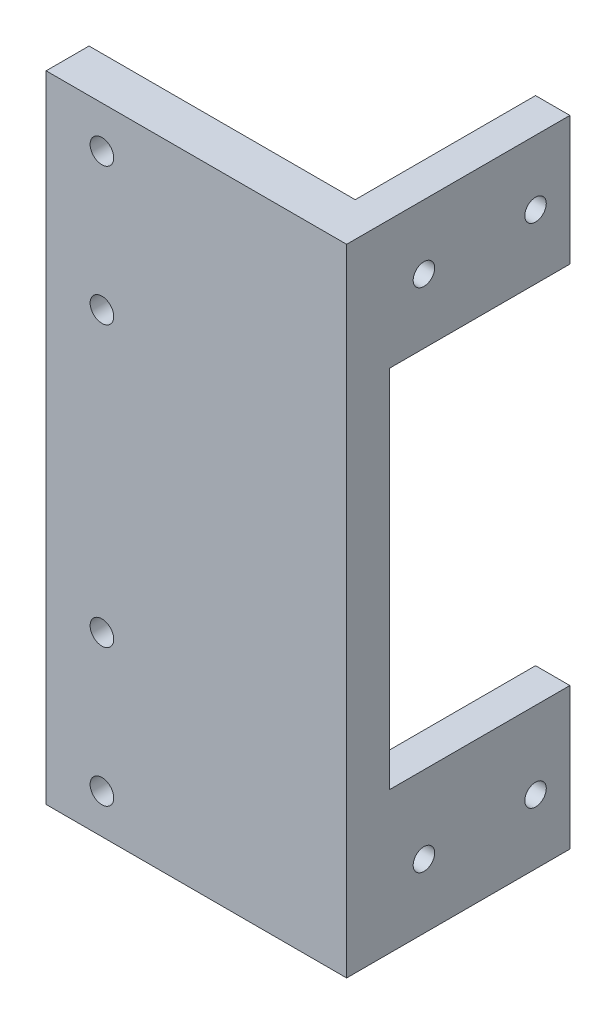
ISO-10303-21;
HEADER;
FILE_DESCRIPTION(('STEP AP214'),'2;1');
FILE_NAME('part.step','',(''),(''),'','','');
FILE_SCHEMA(('AUTOMOTIVE_DESIGN { 1 0 10303 214 1 1 1 1 }'));
ENDSEC;
DATA;
#1=APPLICATION_CONTEXT('core data for automotive mechanical design processes');
#2=APPLICATION_PROTOCOL_DEFINITION('international standard','automotive_design',2000,#1);
#3=PRODUCT_CONTEXT('',#1,'mechanical');
#4=PRODUCT('Part','Part','',(#3));
#5=PRODUCT_RELATED_PRODUCT_CATEGORY('part','',(#4));
#6=PRODUCT_DEFINITION_FORMATION('','',#4);
#7=PRODUCT_DEFINITION_CONTEXT('part definition',#1,'design');
#8=PRODUCT_DEFINITION('design','',#6,#7);
#9=PRODUCT_DEFINITION_SHAPE('','',#8);
#10=(LENGTH_UNIT() NAMED_UNIT(*) SI_UNIT(.MILLI.,.METRE.));
#11=(NAMED_UNIT(*) PLANE_ANGLE_UNIT() SI_UNIT($,.RADIAN.));
#12=(NAMED_UNIT(*) SI_UNIT($,.STERADIAN.) SOLID_ANGLE_UNIT());
#13=UNCERTAINTY_MEASURE_WITH_UNIT(LENGTH_MEASURE(1.E-05),#10,'distance_accuracy_value','');
#14=(GEOMETRIC_REPRESENTATION_CONTEXT(3) GLOBAL_UNCERTAINTY_ASSIGNED_CONTEXT((#13)) GLOBAL_UNIT_ASSIGNED_CONTEXT((#10,
#11,#12)) REPRESENTATION_CONTEXT('',''));
#15=CARTESIAN_POINT('',(0.,0.,0.));
#16=DIRECTION('',(0.,0.,1.));
#17=DIRECTION('',(1.,0.,0.));
#18=AXIS2_PLACEMENT_3D('',#15,#16,#17);
#19=CARTESIAN_POINT('',(0.,0.,-10.));
#20=DIRECTION('',(0.,0.,1.));
#21=DIRECTION('',(-1.,0.,0.));
#22=AXIS2_PLACEMENT_3D('',#19,#20,#21);
#23=PLANE('',#22);
#24=DIRECTION('',(0.,-1.,0.));
#25=VECTOR('',#24,1.);
#26=CARTESIAN_POINT('',(57.,-144.,-10.));
#27=LINE('',#26,#25);
#28=CARTESIAN_POINT('',(57.,-111.,-10.));
#29=VERTEX_POINT('',#28);
#30=CARTESIAN_POINT('',(57.,-144.,-10.));
#31=VERTEX_POINT('',#30);
#32=EDGE_CURVE('E113',#29,#31,#27,.T.);
#33=ORIENTED_EDGE('',*,*,#32,.T.);
#34=DIRECTION('',(1.,0.,0.));
#35=VECTOR('',#34,1.);
#36=CARTESIAN_POINT('',(-5.00000000000002,-144.,-10.));
#37=LINE('',#36,#35);
#38=CARTESIAN_POINT('',(-5.00000000000002,-144.,-10.));
#39=VERTEX_POINT('',#38);
#40=EDGE_CURVE('E160',#39,#31,#37,.T.);
#41=ORIENTED_EDGE('',*,*,#40,.F.);
#42=DIRECTION('',(0.,-1.,0.));
#43=VECTOR('',#42,1.);
#44=CARTESIAN_POINT('',(-5.00000000000002,-144.,-10.));
#45=LINE('',#44,#43);
#46=CARTESIAN_POINT('',(-5.00000000000002,4.,-10.));
#47=VERTEX_POINT('',#46);
#48=EDGE_CURVE('E157',#47,#39,#45,.T.);
#49=ORIENTED_EDGE('',*,*,#48,.F.);
#50=DIRECTION('',(-1.,0.,0.));
#51=VECTOR('',#50,1.);
#52=CARTESIAN_POINT('',(-5.00000000000002,4.,-10.));
#53=LINE('',#52,#51);
#54=CARTESIAN_POINT('',(57.,4.,-10.));
#55=VERTEX_POINT('',#54);
#56=EDGE_CURVE('E164',#55,#47,#53,.T.);
#57=ORIENTED_EDGE('',*,*,#56,.F.);
#58=DIRECTION('',(0.,-1.,0.));
#59=VECTOR('',#58,1.);
#60=CARTESIAN_POINT('',(57.,4.,-10.));
#61=LINE('',#60,#59);
#62=CARTESIAN_POINT('',(57.,-26.,-10.));
#63=VERTEX_POINT('',#62);
#64=EDGE_CURVE('E192',#55,#63,#61,.T.);
#65=ORIENTED_EDGE('',*,*,#64,.T.);
#66=DIRECTION('',(1.,0.,0.));
#67=VECTOR('',#66,1.);
#68=CARTESIAN_POINT('',(65.,-26.,-10.));
#69=LINE('',#68,#67);
#70=CARTESIAN_POINT('',(65.,-26.,-10.));
#71=VERTEX_POINT('',#70);
#72=EDGE_CURVE('E200',#63,#71,#69,.T.);
#73=ORIENTED_EDGE('',*,*,#72,.T.);
#74=DIRECTION('',(0.,1.,0.));
#75=VECTOR('',#74,1.);
#76=CARTESIAN_POINT('',(65.,-144.,-10.));
#77=LINE('',#76,#75);
#78=CARTESIAN_POINT('',(65.,-111.,-10.));
#79=VERTEX_POINT('',#78);
#80=EDGE_CURVE('E138',#79,#71,#77,.T.);
#81=ORIENTED_EDGE('',*,*,#80,.F.);
#82=DIRECTION('',(-1.,0.,0.));
#83=VECTOR('',#82,1.);
#84=CARTESIAN_POINT('',(15.,-111.,-10.));
#85=LINE('',#84,#83);
#86=EDGE_CURVE('E130',#79,#29,#85,.T.);
#87=ORIENTED_EDGE('',*,*,#86,.T.);
#88=EDGE_LOOP('',(#33,#41,#49,#57,#65,#73,#81,#87));
#89=FACE_BOUND('',#88,.T.);
#90=CARTESIAN_POINT('',(7.99999999999998,-5.70000000000219,-10.));
#91=DIRECTION('',(0.,0.,-1.));
#92=DIRECTION('',(-1.,0.,0.));
#93=AXIS2_PLACEMENT_3D('',#90,#91,#92);
#94=CIRCLE('',#93,2.75);
#95=CARTESIAN_POINT('',(5.24999999999998,-5.70000000000219,-10.));
#96=VERTEX_POINT('',#95);
#97=EDGE_CURVE('E262',#96,#96,#94,.F.);
#98=ORIENTED_EDGE('',*,*,#97,.T.);
#99=EDGE_LOOP('',(#98));
#100=FACE_BOUND('',#99,.T.);
#101=CARTESIAN_POINT('',(7.99999999999999,-37.7000000000022,-10.));
#102=DIRECTION('',(0.,0.,-1.));
#103=DIRECTION('',(-1.,0.,0.));
#104=AXIS2_PLACEMENT_3D('',#101,#102,#103);
#105=CIRCLE('',#104,2.75);
#106=CARTESIAN_POINT('',(5.24999999999999,-37.7000000000022,-10.));
#107=VERTEX_POINT('',#106);
#108=EDGE_CURVE('E256',#107,#107,#105,.F.);
#109=ORIENTED_EDGE('',*,*,#108,.T.);
#110=EDGE_LOOP('',(#109));
#111=FACE_BOUND('',#110,.T.);
#112=CARTESIAN_POINT('',(8.00000000000002,-134.80000000001,-10.));
#113=DIRECTION('',(0.,0.,-1.));
#114=DIRECTION('',(-1.,0.,0.));
#115=AXIS2_PLACEMENT_3D('',#112,#113,#114);
#116=CIRCLE('',#115,2.75);
#117=CARTESIAN_POINT('',(5.25000000000002,-134.80000000001,-10.));
#118=VERTEX_POINT('',#117);
#119=EDGE_CURVE('E250',#118,#118,#116,.F.);
#120=ORIENTED_EDGE('',*,*,#119,.T.);
#121=EDGE_LOOP('',(#120));
#122=FACE_BOUND('',#121,.T.);
#123=CARTESIAN_POINT('',(8.00000000000001,-102.800000000009,-10.));
#124=DIRECTION('',(0.,0.,-1.));
#125=DIRECTION('',(-1.,0.,0.));
#126=AXIS2_PLACEMENT_3D('',#123,#124,#125);
#127=CIRCLE('',#126,2.75);
#128=CARTESIAN_POINT('',(5.25000000000001,-102.800000000009,-10.));
#129=VERTEX_POINT('',#128);
#130=EDGE_CURVE('E244',#129,#129,#127,.F.);
#131=ORIENTED_EDGE('',*,*,#130,.T.);
#132=EDGE_LOOP('',(#131));
#133=FACE_BOUND('',#132,.T.);
#134=ADVANCED_FACE('F33',(#89,#100,#111,#122,#133),#23,.F.);
#135=CARTESIAN_POINT('',(-5.00000000000002,-144.,-10.));
#136=DIRECTION('',(1.,0.,0.));
#137=DIRECTION('',(0.,0.,1.));
#138=AXIS2_PLACEMENT_3D('',#135,#136,#137);
#139=PLANE('',#138);
#140=DIRECTION('',(0.,-1.,0.));
#141=VECTOR('',#140,1.);
#142=CARTESIAN_POINT('',(-5.00000000000002,-144.,0.));
#143=LINE('',#142,#141);
#144=CARTESIAN_POINT('',(-5.00000000000002,4.,0.));
#145=VERTEX_POINT('',#144);
#146=CARTESIAN_POINT('',(-5.00000000000002,-144.,0.));
#147=VERTEX_POINT('',#146);
#148=EDGE_CURVE('E150',#145,#147,#143,.T.);
#149=ORIENTED_EDGE('',*,*,#148,.F.);
#150=DIRECTION('',(0.,0.,1.));
#151=VECTOR('',#150,1.);
#152=CARTESIAN_POINT('',(-5.00000000000002,4.,-10.));
#153=LINE('',#152,#151);
#154=EDGE_CURVE('E166',#47,#145,#153,.T.);
#155=ORIENTED_EDGE('',*,*,#154,.F.);
#156=ORIENTED_EDGE('',*,*,#48,.T.);
#157=DIRECTION('',(0.,0.,1.));
#158=VECTOR('',#157,1.);
#159=CARTESIAN_POINT('',(-5.00000000000002,-144.,-10.));
#160=LINE('',#159,#158);
#161=EDGE_CURVE('E11',#39,#147,#160,.T.);
#162=ORIENTED_EDGE('',*,*,#161,.T.);
#163=EDGE_LOOP('',(#149,#155,#156,#162));
#164=FACE_BOUND('',#163,.T.);
#165=ADVANCED_FACE('F35',(#164),#139,.F.);
#166=CARTESIAN_POINT('',(-5.00000000000002,-144.,-10.));
#167=DIRECTION('',(0.,1.,0.));
#168=DIRECTION('',(0.,0.,-1.));
#169=AXIS2_PLACEMENT_3D('',#166,#167,#168);
#170=PLANE('',#169);
#171=DIRECTION('',(1.,0.,0.));
#172=VECTOR('',#171,1.);
#173=CARTESIAN_POINT('',(-5.00000000000002,-144.,0.));
#174=LINE('',#173,#172);
#175=CARTESIAN_POINT('',(65.,-144.,0.));
#176=VERTEX_POINT('',#175);
#177=EDGE_CURVE('E153',#147,#176,#174,.T.);
#178=ORIENTED_EDGE('',*,*,#177,.F.);
#179=ORIENTED_EDGE('',*,*,#161,.F.);
#180=ORIENTED_EDGE('',*,*,#40,.T.);
#181=DIRECTION('',(0.,0.,1.));
#182=VECTOR('',#181,1.);
#183=CARTESIAN_POINT('',(57.,-144.,-52.));
#184=LINE('',#183,#182);
#185=CARTESIAN_POINT('',(57.,-144.,-52.));
#186=VERTEX_POINT('',#185);
#187=EDGE_CURVE('E119',#186,#31,#184,.T.);
#188=ORIENTED_EDGE('',*,*,#187,.F.);
#189=DIRECTION('',(1.,0.,0.));
#190=VECTOR('',#189,1.);
#191=CARTESIAN_POINT('',(65.,-144.,-52.));
#192=LINE('',#191,#190);
#193=CARTESIAN_POINT('',(65.,-144.,-52.));
#194=VERTEX_POINT('',#193);
#195=EDGE_CURVE('E184',#186,#194,#192,.T.);
#196=ORIENTED_EDGE('',*,*,#195,.T.);
#197=DIRECTION('',(0.,0.,1.));
#198=VECTOR('',#197,1.);
#199=CARTESIAN_POINT('',(65.,-144.,-10.));
#200=LINE('',#199,#198);
#201=EDGE_CURVE('E42',#194,#176,#200,.T.);
#202=ORIENTED_EDGE('',*,*,#201,.T.);
#203=EDGE_LOOP('',(#178,#179,#180,#188,#196,#202));
#204=FACE_BOUND('',#203,.T.);
#205=ADVANCED_FACE('F183',(#204),#170,.F.);
#206=CARTESIAN_POINT('',(65.,-144.,-10.));
#207=DIRECTION('',(-1.,0.,0.));
#208=DIRECTION('',(0.,-1.,0.));
#209=AXIS2_PLACEMENT_3D('',#206,#207,#208);
#210=PLANE('',#209);
#211=CARTESIAN_POINT('',(65.,-129.,-18.));
#212=DIRECTION('',(1.,0.,0.));
#213=DIRECTION('',(0.,-1.,0.));
#214=AXIS2_PLACEMENT_3D('',#211,#212,#213);
#215=CIRCLE('',#214,2.5);
#216=CARTESIAN_POINT('',(65.,-131.5,-18.));
#217=VERTEX_POINT('',#216);
#218=EDGE_CURVE('E238',#217,#217,#215,.F.);
#219=ORIENTED_EDGE('',*,*,#218,.T.);
#220=EDGE_LOOP('',(#219));
#221=FACE_BOUND('',#220,.T.);
#222=CARTESIAN_POINT('',(65.,-129.,-44.));
#223=DIRECTION('',(1.,0.,0.));
#224=DIRECTION('',(0.,-1.,0.));
#225=AXIS2_PLACEMENT_3D('',#222,#223,#224);
#226=CIRCLE('',#225,2.5);
#227=CARTESIAN_POINT('',(65.,-131.5,-44.));
#228=VERTEX_POINT('',#227);
#229=EDGE_CURVE('E232',#228,#228,#226,.F.);
#230=ORIENTED_EDGE('',*,*,#229,.T.);
#231=EDGE_LOOP('',(#230));
#232=FACE_BOUND('',#231,.T.);
#233=CARTESIAN_POINT('',(65.,-11.,-44.));
#234=DIRECTION('',(1.,0.,0.));
#235=DIRECTION('',(0.,-1.,0.));
#236=AXIS2_PLACEMENT_3D('',#233,#234,#235);
#237=CIRCLE('',#236,2.5);
#238=CARTESIAN_POINT('',(65.,-13.5,-44.));
#239=VERTEX_POINT('',#238);
#240=EDGE_CURVE('E226',#239,#239,#237,.F.);
#241=ORIENTED_EDGE('',*,*,#240,.T.);
#242=EDGE_LOOP('',(#241));
#243=FACE_BOUND('',#242,.T.);
#244=CARTESIAN_POINT('',(65.,-11.,-18.));
#245=DIRECTION('',(1.,0.,0.));
#246=DIRECTION('',(0.,-1.,0.));
#247=AXIS2_PLACEMENT_3D('',#244,#245,#246);
#248=CIRCLE('',#247,2.5);
#249=CARTESIAN_POINT('',(65.,-13.5,-18.));
#250=VERTEX_POINT('',#249);
#251=EDGE_CURVE('E124',#250,#250,#248,.F.);
#252=ORIENTED_EDGE('',*,*,#251,.T.);
#253=EDGE_LOOP('',(#252));
#254=FACE_BOUND('',#253,.T.);
#255=DIRECTION('',(0.,1.,0.));
#256=VECTOR('',#255,1.);
#257=CARTESIAN_POINT('',(65.,-144.,0.));
#258=LINE('',#257,#256);
#259=CARTESIAN_POINT('',(65.,4.,0.));
#260=VERTEX_POINT('',#259);
#261=EDGE_CURVE('E170',#176,#260,#258,.T.);
#262=ORIENTED_EDGE('',*,*,#261,.F.);
#263=ORIENTED_EDGE('',*,*,#201,.F.);
#264=DIRECTION('',(0.,1.,0.));
#265=VECTOR('',#264,1.);
#266=CARTESIAN_POINT('',(65.,-111.,-52.));
#267=LINE('',#266,#265);
#268=CARTESIAN_POINT('',(65.,-111.,-52.));
#269=VERTEX_POINT('',#268);
#270=EDGE_CURVE('E139',#194,#269,#267,.T.);
#271=ORIENTED_EDGE('',*,*,#270,.T.);
#272=DIRECTION('',(0.,0.,1.));
#273=VECTOR('',#272,1.);
#274=CARTESIAN_POINT('',(65.,-111.,-52.));
#275=LINE('',#274,#273);
#276=EDGE_CURVE('E149',#269,#79,#275,.T.);
#277=ORIENTED_EDGE('',*,*,#276,.T.);
#278=ORIENTED_EDGE('',*,*,#80,.T.);
#279=DIRECTION('',(0.,0.,1.));
#280=VECTOR('',#279,1.);
#281=CARTESIAN_POINT('',(65.,-26.,-52.));
#282=LINE('',#281,#280);
#283=CARTESIAN_POINT('',(65.,-26.,-52.));
#284=VERTEX_POINT('',#283);
#285=EDGE_CURVE('E209',#284,#71,#282,.T.);
#286=ORIENTED_EDGE('',*,*,#285,.F.);
#287=DIRECTION('',(0.,1.,0.));
#288=VECTOR('',#287,1.);
#289=CARTESIAN_POINT('',(65.,4.,-52.));
#290=LINE('',#289,#288);
#291=CARTESIAN_POINT('',(65.,4.,-52.));
#292=VERTEX_POINT('',#291);
#293=EDGE_CURVE('E202',#284,#292,#290,.T.);
#294=ORIENTED_EDGE('',*,*,#293,.T.);
#295=DIRECTION('',(0.,0.,1.));
#296=VECTOR('',#295,1.);
#297=CARTESIAN_POINT('',(65.,4.,-10.));
#298=LINE('',#297,#296);
#299=EDGE_CURVE('E176',#292,#260,#298,.T.);
#300=ORIENTED_EDGE('',*,*,#299,.T.);
#301=EDGE_LOOP('',(#262,#263,#271,#277,#278,#286,#294,#300));
#302=FACE_BOUND('',#301,.T.);
#303=ADVANCED_FACE('F294',(#221,#232,#243,#254,#302),#210,.F.);
#304=CARTESIAN_POINT('',(-5.00000000000002,4.,-10.));
#305=DIRECTION('',(0.,-1.,0.));
#306=DIRECTION('',(0.,0.,1.));
#307=AXIS2_PLACEMENT_3D('',#304,#305,#306);
#308=PLANE('',#307);
#309=DIRECTION('',(-1.,0.,0.));
#310=VECTOR('',#309,1.);
#311=CARTESIAN_POINT('',(-5.00000000000002,4.,0.));
#312=LINE('',#311,#310);
#313=EDGE_CURVE('E161',#260,#145,#312,.T.);
#314=ORIENTED_EDGE('',*,*,#313,.F.);
#315=ORIENTED_EDGE('',*,*,#299,.F.);
#316=DIRECTION('',(-1.,0.,0.));
#317=VECTOR('',#316,1.);
#318=CARTESIAN_POINT('',(65.,4.,-52.));
#319=LINE('',#318,#317);
#320=CARTESIAN_POINT('',(57.,4.,-52.));
#321=VERTEX_POINT('',#320);
#322=EDGE_CURVE('E198',#292,#321,#319,.T.);
#323=ORIENTED_EDGE('',*,*,#322,.T.);
#324=DIRECTION('',(0.,0.,1.));
#325=VECTOR('',#324,1.);
#326=CARTESIAN_POINT('',(57.,4.,-52.));
#327=LINE('',#326,#325);
#328=EDGE_CURVE('E140',#321,#55,#327,.T.);
#329=ORIENTED_EDGE('',*,*,#328,.T.);
#330=ORIENTED_EDGE('',*,*,#56,.T.);
#331=ORIENTED_EDGE('',*,*,#154,.T.);
#332=EDGE_LOOP('',(#314,#315,#323,#329,#330,#331));
#333=FACE_BOUND('',#332,.T.);
#334=ADVANCED_FACE('F194',(#333),#308,.F.);
#335=CARTESIAN_POINT('',(0.,0.,0.));
#336=DIRECTION('',(0.,0.,1.));
#337=DIRECTION('',(-1.,0.,0.));
#338=AXIS2_PLACEMENT_3D('',#335,#336,#337);
#339=PLANE('',#338);
#340=CARTESIAN_POINT('',(7.99999999999998,-5.70000000000219,0.));
#341=DIRECTION('',(0.,0.,-1.));
#342=DIRECTION('',(-1.,0.,0.));
#343=AXIS2_PLACEMENT_3D('',#340,#341,#342);
#344=CIRCLE('',#343,2.75);
#345=CARTESIAN_POINT('',(5.24999999999998,-5.70000000000219,0.));
#346=VERTEX_POINT('',#345);
#347=EDGE_CURVE('E133',#346,#346,#344,.T.);
#348=ORIENTED_EDGE('',*,*,#347,.T.);
#349=EDGE_LOOP('',(#348));
#350=FACE_BOUND('',#349,.T.);
#351=CARTESIAN_POINT('',(7.99999999999999,-37.7000000000022,0.));
#352=DIRECTION('',(0.,0.,-1.));
#353=DIRECTION('',(-1.,0.,0.));
#354=AXIS2_PLACEMENT_3D('',#351,#352,#353);
#355=CIRCLE('',#354,2.75);
#356=CARTESIAN_POINT('',(5.24999999999999,-37.7000000000022,0.));
#357=VERTEX_POINT('',#356);
#358=EDGE_CURVE('E259',#357,#357,#355,.T.);
#359=ORIENTED_EDGE('',*,*,#358,.T.);
#360=EDGE_LOOP('',(#359));
#361=FACE_BOUND('',#360,.T.);
#362=CARTESIAN_POINT('',(8.00000000000002,-134.80000000001,0.));
#363=DIRECTION('',(0.,0.,-1.));
#364=DIRECTION('',(-1.,0.,0.));
#365=AXIS2_PLACEMENT_3D('',#362,#363,#364);
#366=CIRCLE('',#365,2.75);
#367=CARTESIAN_POINT('',(5.25000000000002,-134.80000000001,0.));
#368=VERTEX_POINT('',#367);
#369=EDGE_CURVE('E253',#368,#368,#366,.T.);
#370=ORIENTED_EDGE('',*,*,#369,.T.);
#371=EDGE_LOOP('',(#370));
#372=FACE_BOUND('',#371,.T.);
#373=CARTESIAN_POINT('',(8.00000000000001,-102.800000000009,0.));
#374=DIRECTION('',(0.,0.,-1.));
#375=DIRECTION('',(-1.,0.,0.));
#376=AXIS2_PLACEMENT_3D('',#373,#374,#375);
#377=CIRCLE('',#376,2.75);
#378=CARTESIAN_POINT('',(5.25000000000001,-102.800000000009,0.));
#379=VERTEX_POINT('',#378);
#380=EDGE_CURVE('E247',#379,#379,#377,.T.);
#381=ORIENTED_EDGE('',*,*,#380,.T.);
#382=EDGE_LOOP('',(#381));
#383=FACE_BOUND('',#382,.T.);
#384=ORIENTED_EDGE('',*,*,#148,.T.);
#385=ORIENTED_EDGE('',*,*,#177,.T.);
#386=ORIENTED_EDGE('',*,*,#261,.T.);
#387=ORIENTED_EDGE('',*,*,#313,.T.);
#388=EDGE_LOOP('',(#384,#385,#386,#387));
#389=FACE_BOUND('',#388,.T.);
#390=ADVANCED_FACE('F186',(#350,#361,#372,#383,#389),#339,.T.);
#391=CARTESIAN_POINT('',(15.,-111.,-52.));
#392=DIRECTION('',(0.,-1.,0.));
#393=DIRECTION('',(0.,0.,1.));
#394=AXIS2_PLACEMENT_3D('',#391,#392,#393);
#395=PLANE('',#394);
#396=DIRECTION('',(-1.,0.,0.));
#397=VECTOR('',#396,1.);
#398=CARTESIAN_POINT('',(15.,-111.,-52.));
#399=LINE('',#398,#397);
#400=CARTESIAN_POINT('',(57.,-111.,-52.));
#401=VERTEX_POINT('',#400);
#402=EDGE_CURVE('E132',#269,#401,#399,.T.);
#403=ORIENTED_EDGE('',*,*,#402,.T.);
#404=DIRECTION('',(0.,0.,-1.));
#405=VECTOR('',#404,1.);
#406=CARTESIAN_POINT('',(57.,-111.,-10.));
#407=LINE('',#406,#405);
#408=EDGE_CURVE('E116',#29,#401,#407,.T.);
#409=ORIENTED_EDGE('',*,*,#408,.F.);
#410=ORIENTED_EDGE('',*,*,#86,.F.);
#411=ORIENTED_EDGE('',*,*,#276,.F.);
#412=EDGE_LOOP('',(#403,#409,#410,#411));
#413=FACE_BOUND('',#412,.T.);
#414=ADVANCED_FACE('F128',(#413),#395,.F.);
#415=CARTESIAN_POINT('',(0.,0.,-52.));
#416=DIRECTION('',(0.,0.,-1.));
#417=DIRECTION('',(1.,0.,0.));
#418=AXIS2_PLACEMENT_3D('',#415,#416,#417);
#419=PLANE('',#418);
#420=DIRECTION('',(0.,-1.,0.));
#421=VECTOR('',#420,1.);
#422=CARTESIAN_POINT('',(57.,-144.,-52.));
#423=LINE('',#422,#421);
#424=EDGE_CURVE('E50',#401,#186,#423,.T.);
#425=ORIENTED_EDGE('',*,*,#424,.F.);
#426=ORIENTED_EDGE('',*,*,#402,.F.);
#427=ORIENTED_EDGE('',*,*,#270,.F.);
#428=ORIENTED_EDGE('',*,*,#195,.F.);
#429=EDGE_LOOP('',(#425,#426,#427,#428));
#430=FACE_BOUND('',#429,.T.);
#431=ADVANCED_FACE('F321',(#430),#419,.T.);
#432=CARTESIAN_POINT('',(57.,4.,-52.));
#433=DIRECTION('',(1.,0.,0.));
#434=DIRECTION('',(0.,1.,0.));
#435=AXIS2_PLACEMENT_3D('',#432,#433,#434);
#436=PLANE('',#435);
#437=CARTESIAN_POINT('',(57.,-11.,-44.));
#438=DIRECTION('',(1.,0.,0.));
#439=DIRECTION('',(0.,-1.,0.));
#440=AXIS2_PLACEMENT_3D('',#437,#438,#439);
#441=CIRCLE('',#440,2.5);
#442=CARTESIAN_POINT('',(57.,-13.5,-44.));
#443=VERTEX_POINT('',#442);
#444=EDGE_CURVE('E229',#443,#443,#441,.T.);
#445=ORIENTED_EDGE('',*,*,#444,.T.);
#446=EDGE_LOOP('',(#445));
#447=FACE_BOUND('',#446,.T.);
#448=CARTESIAN_POINT('',(57.,-11.,-18.));
#449=DIRECTION('',(1.,0.,0.));
#450=DIRECTION('',(0.,-1.,0.));
#451=AXIS2_PLACEMENT_3D('',#448,#449,#450);
#452=CIRCLE('',#451,2.5);
#453=CARTESIAN_POINT('',(57.,-13.5,-18.));
#454=VERTEX_POINT('',#453);
#455=EDGE_CURVE('E223',#454,#454,#452,.T.);
#456=ORIENTED_EDGE('',*,*,#455,.T.);
#457=EDGE_LOOP('',(#456));
#458=FACE_BOUND('',#457,.T.);
#459=ORIENTED_EDGE('',*,*,#64,.F.);
#460=ORIENTED_EDGE('',*,*,#328,.F.);
#461=DIRECTION('',(0.,-1.,0.));
#462=VECTOR('',#461,1.);
#463=CARTESIAN_POINT('',(57.,4.,-52.));
#464=LINE('',#463,#462);
#465=CARTESIAN_POINT('',(57.,-26.,-52.));
#466=VERTEX_POINT('',#465);
#467=EDGE_CURVE('E213',#321,#466,#464,.T.);
#468=ORIENTED_EDGE('',*,*,#467,.T.);
#469=DIRECTION('',(0.,0.,1.));
#470=VECTOR('',#469,1.);
#471=CARTESIAN_POINT('',(57.,-26.,-52.));
#472=LINE('',#471,#470);
#473=EDGE_CURVE('E58',#466,#63,#472,.T.);
#474=ORIENTED_EDGE('',*,*,#473,.T.);
#475=EDGE_LOOP('',(#459,#460,#468,#474));
#476=FACE_BOUND('',#475,.T.);
#477=ADVANCED_FACE('F199',(#447,#458,#476),#436,.F.);
#478=CARTESIAN_POINT('',(65.,-26.,-52.));
#479=DIRECTION('',(0.,1.,0.));
#480=DIRECTION('',(0.,0.,-1.));
#481=AXIS2_PLACEMENT_3D('',#478,#479,#480);
#482=PLANE('',#481);
#483=ORIENTED_EDGE('',*,*,#72,.F.);
#484=ORIENTED_EDGE('',*,*,#473,.F.);
#485=DIRECTION('',(1.,0.,0.));
#486=VECTOR('',#485,1.);
#487=CARTESIAN_POINT('',(65.,-26.,-52.));
#488=LINE('',#487,#486);
#489=EDGE_CURVE('E206',#466,#284,#488,.T.);
#490=ORIENTED_EDGE('',*,*,#489,.T.);
#491=ORIENTED_EDGE('',*,*,#285,.T.);
#492=EDGE_LOOP('',(#483,#484,#490,#491));
#493=FACE_BOUND('',#492,.T.);
#494=ADVANCED_FACE('F332',(#493),#482,.F.);
#495=CARTESIAN_POINT('',(0.,0.,-52.));
#496=DIRECTION('',(0.,0.,1.));
#497=DIRECTION('',(-1.,0.,0.));
#498=AXIS2_PLACEMENT_3D('',#495,#496,#497);
#499=PLANE('',#498);
#500=ORIENTED_EDGE('',*,*,#293,.F.);
#501=ORIENTED_EDGE('',*,*,#489,.F.);
#502=ORIENTED_EDGE('',*,*,#467,.F.);
#503=ORIENTED_EDGE('',*,*,#322,.F.);
#504=EDGE_LOOP('',(#500,#501,#502,#503));
#505=FACE_BOUND('',#504,.T.);
#506=ADVANCED_FACE('F340',(#505),#499,.F.);
#507=CARTESIAN_POINT('',(57.,-144.,-52.));
#508=DIRECTION('',(1.,0.,0.));
#509=DIRECTION('',(0.,0.,1.));
#510=AXIS2_PLACEMENT_3D('',#507,#508,#509);
#511=PLANE('',#510);
#512=CARTESIAN_POINT('',(57.,-129.,-18.));
#513=DIRECTION('',(1.,0.,0.));
#514=DIRECTION('',(0.,1.,0.));
#515=AXIS2_PLACEMENT_3D('',#512,#513,#514);
#516=CIRCLE('',#515,2.5);
#517=CARTESIAN_POINT('',(57.,-126.5,-18.));
#518=VERTEX_POINT('',#517);
#519=EDGE_CURVE('E241',#518,#518,#516,.T.);
#520=ORIENTED_EDGE('',*,*,#519,.T.);
#521=EDGE_LOOP('',(#520));
#522=FACE_BOUND('',#521,.T.);
#523=CARTESIAN_POINT('',(57.,-129.,-44.));
#524=DIRECTION('',(1.,0.,0.));
#525=DIRECTION('',(0.,1.,0.));
#526=AXIS2_PLACEMENT_3D('',#523,#524,#525);
#527=CIRCLE('',#526,2.5);
#528=CARTESIAN_POINT('',(57.,-126.5,-44.));
#529=VERTEX_POINT('',#528);
#530=EDGE_CURVE('E235',#529,#529,#527,.T.);
#531=ORIENTED_EDGE('',*,*,#530,.T.);
#532=EDGE_LOOP('',(#531));
#533=FACE_BOUND('',#532,.T.);
#534=ORIENTED_EDGE('',*,*,#187,.T.);
#535=ORIENTED_EDGE('',*,*,#32,.F.);
#536=ORIENTED_EDGE('',*,*,#408,.T.);
#537=ORIENTED_EDGE('',*,*,#424,.T.);
#538=EDGE_LOOP('',(#534,#535,#536,#537));
#539=FACE_BOUND('',#538,.T.);
#540=ADVANCED_FACE('F115',(#522,#533,#539),#511,.F.);
#541=CARTESIAN_POINT('',(72.0710678118655,-11.,-18.));
#542=DIRECTION('',(-1.,0.,0.));
#543=DIRECTION('',(0.,-1.,0.));
#544=AXIS2_PLACEMENT_3D('',#541,#542,#543);
#545=CYLINDRICAL_SURFACE('',#544,2.5);
#546=ORIENTED_EDGE('',*,*,#251,.F.);
#547=EDGE_LOOP('',(#546));
#548=FACE_BOUND('',#547,.T.);
#549=ORIENTED_EDGE('',*,*,#455,.F.);
#550=EDGE_LOOP('',(#549));
#551=FACE_BOUND('',#550,.T.);
#552=ADVANCED_FACE('F354',(#548,#551),#545,.F.);
#553=CARTESIAN_POINT('',(72.0710678118655,-11.,-44.));
#554=DIRECTION('',(-1.,0.,0.));
#555=DIRECTION('',(0.,-1.,0.));
#556=AXIS2_PLACEMENT_3D('',#553,#554,#555);
#557=CYLINDRICAL_SURFACE('',#556,2.5);
#558=ORIENTED_EDGE('',*,*,#240,.F.);
#559=EDGE_LOOP('',(#558));
#560=FACE_BOUND('',#559,.T.);
#561=ORIENTED_EDGE('',*,*,#444,.F.);
#562=EDGE_LOOP('',(#561));
#563=FACE_BOUND('',#562,.T.);
#564=ADVANCED_FACE('F361',(#560,#563),#557,.F.);
#565=CARTESIAN_POINT('',(72.0710678118655,-129.,-44.));
#566=DIRECTION('',(-1.,0.,0.));
#567=DIRECTION('',(0.,-1.,0.));
#568=AXIS2_PLACEMENT_3D('',#565,#566,#567);
#569=CYLINDRICAL_SURFACE('',#568,2.5);
#570=ORIENTED_EDGE('',*,*,#229,.F.);
#571=EDGE_LOOP('',(#570));
#572=FACE_BOUND('',#571,.T.);
#573=ORIENTED_EDGE('',*,*,#530,.F.);
#574=EDGE_LOOP('',(#573));
#575=FACE_BOUND('',#574,.T.);
#576=ADVANCED_FACE('F369',(#572,#575),#569,.F.);
#577=CARTESIAN_POINT('',(72.0710678118655,-129.,-18.));
#578=DIRECTION('',(-1.,0.,0.));
#579=DIRECTION('',(0.,-1.,0.));
#580=AXIS2_PLACEMENT_3D('',#577,#578,#579);
#581=CYLINDRICAL_SURFACE('',#580,2.5);
#582=ORIENTED_EDGE('',*,*,#218,.F.);
#583=EDGE_LOOP('',(#582));
#584=FACE_BOUND('',#583,.T.);
#585=ORIENTED_EDGE('',*,*,#519,.F.);
#586=EDGE_LOOP('',(#585));
#587=FACE_BOUND('',#586,.T.);
#588=ADVANCED_FACE('F377',(#584,#587),#581,.F.);
#589=CARTESIAN_POINT('',(8.00000000000001,-102.800000000009,-17.778174593052));
#590=DIRECTION('',(0.,0.,1.));
#591=DIRECTION('',(-1.,0.,0.));
#592=AXIS2_PLACEMENT_3D('',#589,#590,#591);
#593=CYLINDRICAL_SURFACE('',#592,2.75);
#594=ORIENTED_EDGE('',*,*,#130,.F.);
#595=EDGE_LOOP('',(#594));
#596=FACE_BOUND('',#595,.T.);
#597=ORIENTED_EDGE('',*,*,#380,.F.);
#598=EDGE_LOOP('',(#597));
#599=FACE_BOUND('',#598,.T.);
#600=ADVANCED_FACE('F385',(#596,#599),#593,.F.);
#601=CARTESIAN_POINT('',(8.00000000000002,-134.80000000001,-17.778174593052));
#602=DIRECTION('',(0.,0.,1.));
#603=DIRECTION('',(-1.,0.,0.));
#604=AXIS2_PLACEMENT_3D('',#601,#602,#603);
#605=CYLINDRICAL_SURFACE('',#604,2.75);
#606=ORIENTED_EDGE('',*,*,#119,.F.);
#607=EDGE_LOOP('',(#606));
#608=FACE_BOUND('',#607,.T.);
#609=ORIENTED_EDGE('',*,*,#369,.F.);
#610=EDGE_LOOP('',(#609));
#611=FACE_BOUND('',#610,.T.);
#612=ADVANCED_FACE('F278',(#608,#611),#605,.F.);
#613=CARTESIAN_POINT('',(7.99999999999999,-37.7000000000022,-17.778174593052));
#614=DIRECTION('',(0.,0.,1.));
#615=DIRECTION('',(-1.,0.,0.));
#616=AXIS2_PLACEMENT_3D('',#613,#614,#615);
#617=CYLINDRICAL_SURFACE('',#616,2.75);
#618=ORIENTED_EDGE('',*,*,#108,.F.);
#619=EDGE_LOOP('',(#618));
#620=FACE_BOUND('',#619,.T.);
#621=ORIENTED_EDGE('',*,*,#358,.F.);
#622=EDGE_LOOP('',(#621));
#623=FACE_BOUND('',#622,.T.);
#624=ADVANCED_FACE('F272',(#620,#623),#617,.F.);
#625=CARTESIAN_POINT('',(7.99999999999998,-5.70000000000219,-17.778174593052));
#626=DIRECTION('',(0.,0.,1.));
#627=DIRECTION('',(-1.,0.,0.));
#628=AXIS2_PLACEMENT_3D('',#625,#626,#627);
#629=CYLINDRICAL_SURFACE('',#628,2.75);
#630=ORIENTED_EDGE('',*,*,#97,.F.);
#631=EDGE_LOOP('',(#630));
#632=FACE_BOUND('',#631,.T.);
#633=ORIENTED_EDGE('',*,*,#347,.F.);
#634=EDGE_LOOP('',(#633));
#635=FACE_BOUND('',#634,.T.);
#636=ADVANCED_FACE('F270',(#632,#635),#629,.F.);
#637=CLOSED_SHELL('',(#134,#165,#205,#303,#334,#390,#414,#431,#477,#494,#506,#540,#552,#564,
#576,#588,#600,#612,#624,#636));
#638=MANIFOLD_SOLID_BREP('B2',#637);
#639=ADVANCED_BREP_SHAPE_REPRESENTATION('',(#18,#638),#14);
#640=SHAPE_DEFINITION_REPRESENTATION(#9,#639);
ENDSEC;
END-ISO-10303-21;
